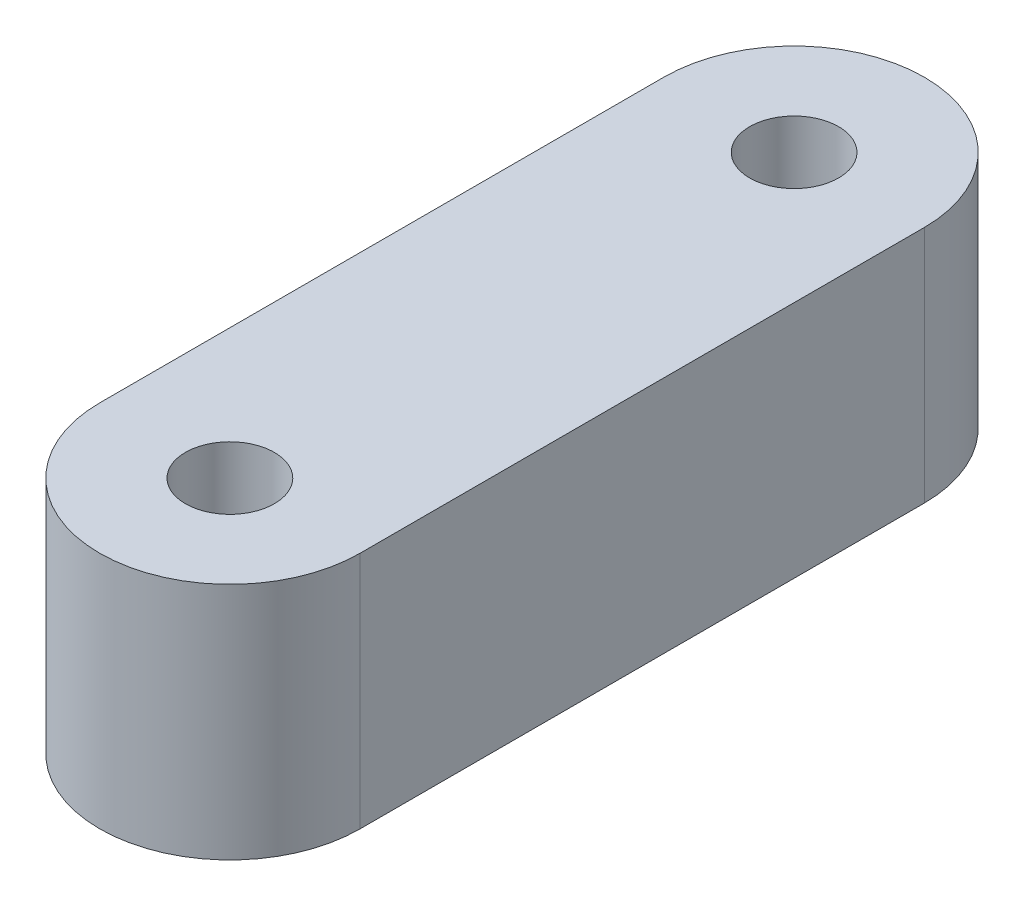
ISO-10303-21;
HEADER;
FILE_DESCRIPTION(('STEP AP214'),'2;1');
FILE_NAME('part.step','',(''),(''),'','','');
FILE_SCHEMA(('AUTOMOTIVE_DESIGN { 1 0 10303 214 1 1 1 1 }'));
ENDSEC;
DATA;
#1=APPLICATION_CONTEXT('core data for automotive mechanical design processes');
#2=APPLICATION_PROTOCOL_DEFINITION('international standard','automotive_design',2000,#1);
#3=PRODUCT_CONTEXT('',#1,'mechanical');
#4=PRODUCT('Part','Part','',(#3));
#5=PRODUCT_RELATED_PRODUCT_CATEGORY('part','',(#4));
#6=PRODUCT_DEFINITION_FORMATION('','',#4);
#7=PRODUCT_DEFINITION_CONTEXT('part definition',#1,'design');
#8=PRODUCT_DEFINITION('design','',#6,#7);
#9=PRODUCT_DEFINITION_SHAPE('','',#8);
#10=(LENGTH_UNIT() NAMED_UNIT(*) SI_UNIT(.MILLI.,.METRE.));
#11=(NAMED_UNIT(*) PLANE_ANGLE_UNIT() SI_UNIT($,.RADIAN.));
#12=(NAMED_UNIT(*) SI_UNIT($,.STERADIAN.) SOLID_ANGLE_UNIT());
#13=UNCERTAINTY_MEASURE_WITH_UNIT(LENGTH_MEASURE(1.E-05),#10,'distance_accuracy_value','');
#14=(GEOMETRIC_REPRESENTATION_CONTEXT(3) GLOBAL_UNCERTAINTY_ASSIGNED_CONTEXT((#13)) GLOBAL_UNIT_ASSIGNED_CONTEXT((#10,
#11,#12)) REPRESENTATION_CONTEXT('',''));
#15=CARTESIAN_POINT('',(0.,0.,0.));
#16=DIRECTION('',(0.,0.,1.));
#17=DIRECTION('',(1.,0.,0.));
#18=AXIS2_PLACEMENT_3D('',#15,#16,#17);
#19=CARTESIAN_POINT('',(0.,11.,13.));
#20=DIRECTION('',(0.,-1.,0.));
#21=DIRECTION('',(0.,0.,-1.));
#22=AXIS2_PLACEMENT_3D('',#19,#20,#21);
#23=CYLINDRICAL_SURFACE('',#22,6.);
#24=CARTESIAN_POINT('',(0.,0.,13.));
#25=DIRECTION('',(0.,1.,0.));
#26=DIRECTION('',(0.,0.,1.));
#27=AXIS2_PLACEMENT_3D('',#24,#25,#26);
#28=CIRCLE('',#27,6.);
#29=CARTESIAN_POINT('',(-6.,0.,13.));
#30=VERTEX_POINT('',#29);
#31=CARTESIAN_POINT('',(6.,0.,13.));
#32=VERTEX_POINT('',#31);
#33=EDGE_CURVE('E101',#30,#32,#28,.T.);
#34=ORIENTED_EDGE('',*,*,#33,.T.);
#35=DIRECTION('',(0.,-1.,0.));
#36=VECTOR('',#35,1.);
#37=CARTESIAN_POINT('',(6.,11.,13.));
#38=LINE('',#37,#36);
#39=CARTESIAN_POINT('',(6.,11.,13.));
#40=VERTEX_POINT('',#39);
#41=EDGE_CURVE('E11',#40,#32,#38,.T.);
#42=ORIENTED_EDGE('',*,*,#41,.F.);
#43=CARTESIAN_POINT('',(0.,11.,13.));
#44=DIRECTION('',(0.,1.,0.));
#45=DIRECTION('',(0.,0.,1.));
#46=AXIS2_PLACEMENT_3D('',#43,#44,#45);
#47=CIRCLE('',#46,6.);
#48=CARTESIAN_POINT('',(-6.,11.,13.));
#49=VERTEX_POINT('',#48);
#50=EDGE_CURVE('E89',#49,#40,#47,.T.);
#51=ORIENTED_EDGE('',*,*,#50,.F.);
#52=DIRECTION('',(0.,-1.,0.));
#53=VECTOR('',#52,1.);
#54=CARTESIAN_POINT('',(-6.,11.,13.));
#55=LINE('',#54,#53);
#56=EDGE_CURVE('E97',#49,#30,#55,.T.);
#57=ORIENTED_EDGE('',*,*,#56,.T.);
#58=EDGE_LOOP('',(#34,#42,#51,#57));
#59=FACE_BOUND('',#58,.T.);
#60=ADVANCED_FACE('F38',(#59),#23,.T.);
#61=CARTESIAN_POINT('',(6.,11.,13.));
#62=DIRECTION('',(-1.,0.,0.));
#63=DIRECTION('',(0.,0.,1.));
#64=AXIS2_PLACEMENT_3D('',#61,#62,#63);
#65=PLANE('',#64);
#66=DIRECTION('',(0.,0.,-1.));
#67=VECTOR('',#66,1.);
#68=CARTESIAN_POINT('',(6.,0.,13.));
#69=LINE('',#68,#67);
#70=CARTESIAN_POINT('',(6.,0.,-13.));
#71=VERTEX_POINT('',#70);
#72=EDGE_CURVE('E93',#32,#71,#69,.T.);
#73=ORIENTED_EDGE('',*,*,#72,.T.);
#74=DIRECTION('',(0.,-1.,0.));
#75=VECTOR('',#74,1.);
#76=CARTESIAN_POINT('',(6.,11.,-13.));
#77=LINE('',#76,#75);
#78=CARTESIAN_POINT('',(6.,11.,-13.));
#79=VERTEX_POINT('',#78);
#80=EDGE_CURVE('E46',#79,#71,#77,.T.);
#81=ORIENTED_EDGE('',*,*,#80,.F.);
#82=DIRECTION('',(0.,0.,-1.));
#83=VECTOR('',#82,1.);
#84=CARTESIAN_POINT('',(6.,11.,13.));
#85=LINE('',#84,#83);
#86=EDGE_CURVE('E84',#40,#79,#85,.T.);
#87=ORIENTED_EDGE('',*,*,#86,.F.);
#88=ORIENTED_EDGE('',*,*,#41,.T.);
#89=EDGE_LOOP('',(#73,#81,#87,#88));
#90=FACE_BOUND('',#89,.T.);
#91=ADVANCED_FACE('F92',(#90),#65,.F.);
#92=CARTESIAN_POINT('',(0.,11.,-13.));
#93=DIRECTION('',(0.,-1.,0.));
#94=DIRECTION('',(0.,0.,-1.));
#95=AXIS2_PLACEMENT_3D('',#92,#93,#94);
#96=CYLINDRICAL_SURFACE('',#95,6.);
#97=CARTESIAN_POINT('',(0.,0.,-13.));
#98=DIRECTION('',(0.,1.,0.));
#99=DIRECTION('',(0.,0.,1.));
#100=AXIS2_PLACEMENT_3D('',#97,#98,#99);
#101=CIRCLE('',#100,6.);
#102=CARTESIAN_POINT('',(-6.00000000000001,0.,-13.));
#103=VERTEX_POINT('',#102);
#104=EDGE_CURVE('E71',#71,#103,#101,.T.);
#105=ORIENTED_EDGE('',*,*,#104,.T.);
#106=DIRECTION('',(0.,-1.,0.));
#107=VECTOR('',#106,1.);
#108=CARTESIAN_POINT('',(-6.00000000000001,11.,-13.));
#109=LINE('',#108,#107);
#110=CARTESIAN_POINT('',(-6.00000000000001,11.,-13.));
#111=VERTEX_POINT('',#110);
#112=EDGE_CURVE('E94',#111,#103,#109,.T.);
#113=ORIENTED_EDGE('',*,*,#112,.F.);
#114=CARTESIAN_POINT('',(0.,11.,-13.));
#115=DIRECTION('',(0.,1.,0.));
#116=DIRECTION('',(0.,0.,1.));
#117=AXIS2_PLACEMENT_3D('',#114,#115,#116);
#118=CIRCLE('',#117,6.);
#119=EDGE_CURVE('E87',#79,#111,#118,.T.);
#120=ORIENTED_EDGE('',*,*,#119,.F.);
#121=ORIENTED_EDGE('',*,*,#80,.T.);
#122=EDGE_LOOP('',(#105,#113,#120,#121));
#123=FACE_BOUND('',#122,.T.);
#124=ADVANCED_FACE('F95',(#123),#96,.T.);
#125=CARTESIAN_POINT('',(-6.,11.,13.));
#126=DIRECTION('',(1.,0.,0.));
#127=DIRECTION('',(0.,0.,-1.));
#128=AXIS2_PLACEMENT_3D('',#125,#126,#127);
#129=PLANE('',#128);
#130=CARTESIAN_POINT('',(-6.,5.5,0.));
#131=DIRECTION('',(-1.,0.,0.));
#132=DIRECTION('',(0.,0.,1.));
#133=AXIS2_PLACEMENT_3D('',#130,#131,#132);
#134=CIRCLE('',#133,3.6);
#135=CARTESIAN_POINT('',(-6.,5.5,3.6));
#136=VERTEX_POINT('',#135);
#137=EDGE_CURVE('E127',#136,#136,#134,.T.);
#138=ORIENTED_EDGE('',*,*,#137,.F.);
#139=EDGE_LOOP('',(#138));
#140=FACE_BOUND('',#139,.T.);
#141=DIRECTION('',(0.,0.,1.));
#142=VECTOR('',#141,1.);
#143=CARTESIAN_POINT('',(-6.,0.,13.));
#144=LINE('',#143,#142);
#145=EDGE_CURVE('E77',#103,#30,#144,.T.);
#146=ORIENTED_EDGE('',*,*,#145,.T.);
#147=ORIENTED_EDGE('',*,*,#56,.F.);
#148=DIRECTION('',(0.,0.,1.));
#149=VECTOR('',#148,1.);
#150=CARTESIAN_POINT('',(-6.,11.,13.));
#151=LINE('',#150,#149);
#152=EDGE_CURVE('E54',#111,#49,#151,.T.);
#153=ORIENTED_EDGE('',*,*,#152,.F.);
#154=ORIENTED_EDGE('',*,*,#112,.T.);
#155=EDGE_LOOP('',(#146,#147,#153,#154));
#156=FACE_BOUND('',#155,.T.);
#157=ADVANCED_FACE('F109',(#140,#156),#129,.F.);
#158=CARTESIAN_POINT('',(0.,11.,13.));
#159=DIRECTION('',(0.,1.,0.));
#160=DIRECTION('',(0.,0.,1.));
#161=AXIS2_PLACEMENT_3D('',#158,#159,#160);
#162=PLANE('',#161);
#163=CARTESIAN_POINT('',(0.,11.,-13.));
#164=DIRECTION('',(0.,1.,0.));
#165=DIRECTION('',(0.,0.,1.));
#166=AXIS2_PLACEMENT_3D('',#163,#164,#165);
#167=CIRCLE('',#166,2.05);
#168=CARTESIAN_POINT('',(0.,11.,-10.95));
#169=VERTEX_POINT('',#168);
#170=EDGE_CURVE('E122',#169,#169,#167,.T.);
#171=ORIENTED_EDGE('',*,*,#170,.F.);
#172=EDGE_LOOP('',(#171));
#173=FACE_BOUND('',#172,.T.);
#174=CARTESIAN_POINT('',(0.,11.,13.));
#175=DIRECTION('',(0.,1.,0.));
#176=DIRECTION('',(0.,0.,1.));
#177=AXIS2_PLACEMENT_3D('',#174,#175,#176);
#178=CIRCLE('',#177,2.05);
#179=CARTESIAN_POINT('',(0.,11.,15.05));
#180=VERTEX_POINT('',#179);
#181=EDGE_CURVE('E115',#180,#180,#178,.T.);
#182=ORIENTED_EDGE('',*,*,#181,.F.);
#183=EDGE_LOOP('',(#182));
#184=FACE_BOUND('',#183,.T.);
#185=ORIENTED_EDGE('',*,*,#50,.T.);
#186=ORIENTED_EDGE('',*,*,#86,.T.);
#187=ORIENTED_EDGE('',*,*,#119,.T.);
#188=ORIENTED_EDGE('',*,*,#152,.T.);
#189=EDGE_LOOP('',(#185,#186,#187,#188));
#190=FACE_BOUND('',#189,.T.);
#191=ADVANCED_FACE('F85',(#173,#184,#190),#162,.T.);
#192=CARTESIAN_POINT('',(0.,0.,13.));
#193=DIRECTION('',(0.,1.,0.));
#194=DIRECTION('',(0.,0.,1.));
#195=AXIS2_PLACEMENT_3D('',#192,#193,#194);
#196=PLANE('',#195);
#197=CARTESIAN_POINT('',(0.,0.,-13.));
#198=DIRECTION('',(0.,1.,0.));
#199=DIRECTION('',(0.,0.,1.));
#200=AXIS2_PLACEMENT_3D('',#197,#198,#199);
#201=CIRCLE('',#200,2.05);
#202=CARTESIAN_POINT('',(0.,0.,-10.95));
#203=VERTEX_POINT('',#202);
#204=EDGE_CURVE('E104',#203,#203,#201,.T.);
#205=ORIENTED_EDGE('',*,*,#204,.T.);
#206=EDGE_LOOP('',(#205));
#207=FACE_BOUND('',#206,.T.);
#208=CARTESIAN_POINT('',(0.,0.,13.));
#209=DIRECTION('',(0.,1.,0.));
#210=DIRECTION('',(0.,0.,1.));
#211=AXIS2_PLACEMENT_3D('',#208,#209,#210);
#212=CIRCLE('',#211,2.05);
#213=CARTESIAN_POINT('',(0.,0.,15.05));
#214=VERTEX_POINT('',#213);
#215=EDGE_CURVE('E118',#214,#214,#212,.T.);
#216=ORIENTED_EDGE('',*,*,#215,.T.);
#217=EDGE_LOOP('',(#216));
#218=FACE_BOUND('',#217,.T.);
#219=ORIENTED_EDGE('',*,*,#33,.F.);
#220=ORIENTED_EDGE('',*,*,#145,.F.);
#221=ORIENTED_EDGE('',*,*,#104,.F.);
#222=ORIENTED_EDGE('',*,*,#72,.F.);
#223=EDGE_LOOP('',(#219,#220,#221,#222));
#224=FACE_BOUND('',#223,.T.);
#225=ADVANCED_FACE('F112',(#207,#218,#224),#196,.F.);
#226=CARTESIAN_POINT('',(0.,0.,13.));
#227=DIRECTION('',(0.,1.,0.));
#228=DIRECTION('',(0.,0.,1.));
#229=AXIS2_PLACEMENT_3D('',#226,#227,#228);
#230=CYLINDRICAL_SURFACE('',#229,2.05);
#231=ORIENTED_EDGE('',*,*,#215,.F.);
#232=EDGE_LOOP('',(#231));
#233=FACE_BOUND('',#232,.T.);
#234=ORIENTED_EDGE('',*,*,#181,.T.);
#235=EDGE_LOOP('',(#234));
#236=FACE_BOUND('',#235,.T.);
#237=ADVANCED_FACE('F178',(#233,#236),#230,.F.);
#238=CARTESIAN_POINT('',(0.,0.,-13.));
#239=DIRECTION('',(0.,1.,0.));
#240=DIRECTION('',(0.,0.,1.));
#241=AXIS2_PLACEMENT_3D('',#238,#239,#240);
#242=CYLINDRICAL_SURFACE('',#241,2.05);
#243=ORIENTED_EDGE('',*,*,#204,.F.);
#244=EDGE_LOOP('',(#243));
#245=FACE_BOUND('',#244,.T.);
#246=ORIENTED_EDGE('',*,*,#170,.T.);
#247=EDGE_LOOP('',(#246));
#248=FACE_BOUND('',#247,.T.);
#249=ADVANCED_FACE('F138',(#245,#248),#242,.F.);
#250=CARTESIAN_POINT('',(4.,5.5,0.));
#251=DIRECTION('',(-1.,0.,0.));
#252=DIRECTION('',(0.,0.,1.));
#253=AXIS2_PLACEMENT_3D('',#250,#251,#252);
#254=CYLINDRICAL_SURFACE('',#253,3.6);
#255=CARTESIAN_POINT('',(4.,5.5,0.));
#256=DIRECTION('',(-1.,0.,0.));
#257=DIRECTION('',(0.,0.,1.));
#258=AXIS2_PLACEMENT_3D('',#255,#256,#257);
#259=CIRCLE('',#258,3.6);
#260=CARTESIAN_POINT('',(4.,5.5,3.6));
#261=VERTEX_POINT('',#260);
#262=EDGE_CURVE('E119',#261,#261,#259,.T.);
#263=ORIENTED_EDGE('',*,*,#262,.F.);
#264=EDGE_LOOP('',(#263));
#265=FACE_BOUND('',#264,.T.);
#266=ORIENTED_EDGE('',*,*,#137,.T.);
#267=EDGE_LOOP('',(#266));
#268=FACE_BOUND('',#267,.T.);
#269=ADVANCED_FACE('F135',(#265,#268),#254,.F.);
#270=CARTESIAN_POINT('',(4.,5.5,0.));
#271=DIRECTION('',(-1.,0.,0.));
#272=DIRECTION('',(0.,0.,1.));
#273=AXIS2_PLACEMENT_3D('',#270,#271,#272);
#274=PLANE('',#273);
#275=ORIENTED_EDGE('',*,*,#262,.T.);
#276=EDGE_LOOP('',(#275));
#277=FACE_BOUND('',#276,.T.);
#278=ADVANCED_FACE('F133',(#277),#274,.T.);
#279=CLOSED_SHELL('',(#60,#91,#124,#157,#191,#225,#237,#249,#269,#278));
#280=MANIFOLD_SOLID_BREP('B2',#279);
#281=ADVANCED_BREP_SHAPE_REPRESENTATION('',(#18,#280),#14);
#282=SHAPE_DEFINITION_REPRESENTATION(#9,#281);
ENDSEC;
END-ISO-10303-21;
